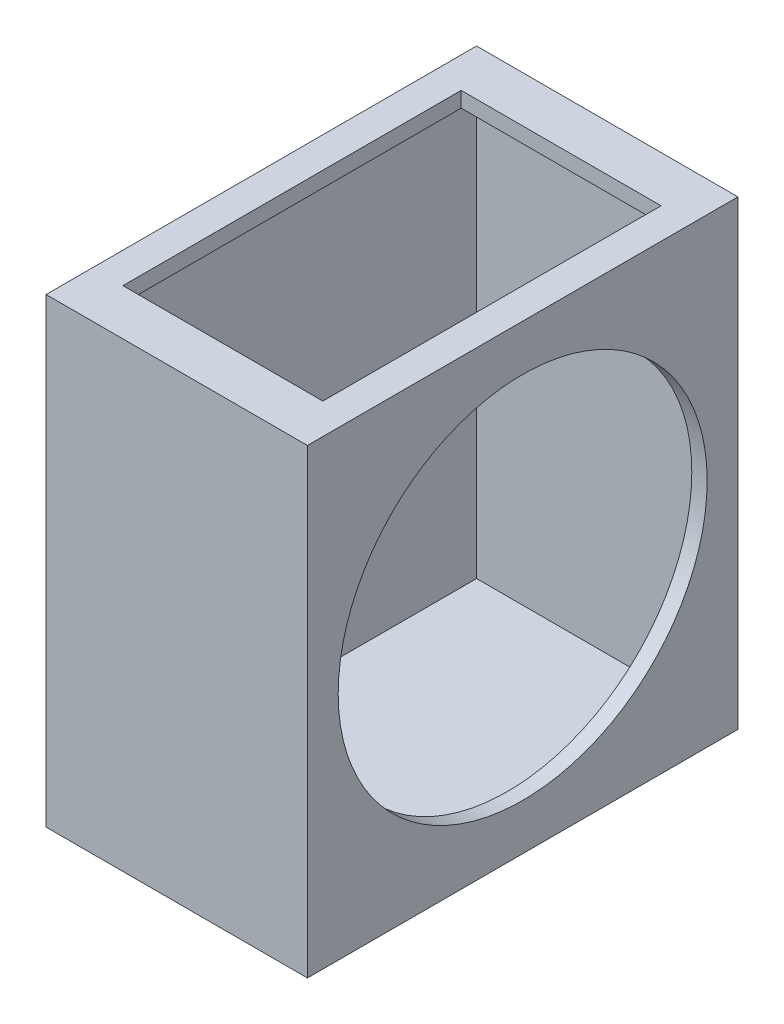
ISO-10303-21;
HEADER;
FILE_DESCRIPTION(('STEP AP214'),'2;1');
FILE_NAME('part.step','',(''),(''),'','','');
FILE_SCHEMA(('AUTOMOTIVE_DESIGN { 1 0 10303 214 1 1 1 1 }'));
ENDSEC;
DATA;
#1=APPLICATION_CONTEXT('core data for automotive mechanical design processes');
#2=APPLICATION_PROTOCOL_DEFINITION('international standard','automotive_design',2000,#1);
#3=PRODUCT_CONTEXT('',#1,'mechanical');
#4=PRODUCT('Part','Part','',(#3));
#5=PRODUCT_RELATED_PRODUCT_CATEGORY('part','',(#4));
#6=PRODUCT_DEFINITION_FORMATION('','',#4);
#7=PRODUCT_DEFINITION_CONTEXT('part definition',#1,'design');
#8=PRODUCT_DEFINITION('design','',#6,#7);
#9=PRODUCT_DEFINITION_SHAPE('','',#8);
#10=(LENGTH_UNIT() NAMED_UNIT(*) SI_UNIT(.MILLI.,.METRE.));
#11=(NAMED_UNIT(*) PLANE_ANGLE_UNIT() SI_UNIT($,.RADIAN.));
#12=(NAMED_UNIT(*) SI_UNIT($,.STERADIAN.) SOLID_ANGLE_UNIT());
#13=UNCERTAINTY_MEASURE_WITH_UNIT(LENGTH_MEASURE(1.E-05),#10,'distance_accuracy_value','');
#14=(GEOMETRIC_REPRESENTATION_CONTEXT(3) GLOBAL_UNCERTAINTY_ASSIGNED_CONTEXT((#13)) GLOBAL_UNIT_ASSIGNED_CONTEXT((#10,
#11,#12)) REPRESENTATION_CONTEXT('',''));
#15=CARTESIAN_POINT('',(0.,0.,0.));
#16=DIRECTION('',(0.,0.,1.));
#17=DIRECTION('',(1.,0.,0.));
#18=AXIS2_PLACEMENT_3D('',#15,#16,#17);
#19=CARTESIAN_POINT('',(-36.2877822295091,77.1183338929011,77.));
#20=DIRECTION('',(0.,-1.,0.));
#21=DIRECTION('',(0.,0.,-1.));
#22=AXIS2_PLACEMENT_3D('',#19,#20,#21);
#23=PLANE('',#22);
#24=DIRECTION('',(0.,0.,-1.));
#25=VECTOR('',#24,1.);
#26=CARTESIAN_POINT('',(43.7122177704909,77.1183338929011,77.));
#27=LINE('',#26,#25);
#28=CARTESIAN_POINT('',(43.7122177704909,77.1183338929011,72.));
#29=VERTEX_POINT('',#28);
#30=CARTESIAN_POINT('',(43.7122177704909,77.1183338929011,-58.));
#31=VERTEX_POINT('',#30);
#32=EDGE_CURVE('E194',#29,#31,#27,.T.);
#33=ORIENTED_EDGE('',*,*,#32,.F.);
#34=DIRECTION('',(-1.,0.,0.));
#35=VECTOR('',#34,1.);
#36=CARTESIAN_POINT('',(6.21221777049086,77.1183338929011,72.));
#37=LINE('',#36,#35);
#38=CARTESIAN_POINT('',(-31.2877822295091,77.1183338929011,72.));
#39=VERTEX_POINT('',#38);
#40=EDGE_CURVE('E210',#29,#39,#37,.T.);
#41=ORIENTED_EDGE('',*,*,#40,.T.);
#42=DIRECTION('',(0.,0.,-1.));
#43=VECTOR('',#42,1.);
#44=CARTESIAN_POINT('',(-31.2877822295091,77.1183338929011,77.));
#45=LINE('',#44,#43);
#46=CARTESIAN_POINT('',(-31.2877822295091,77.1183338929011,-58.));
#47=VERTEX_POINT('',#46);
#48=EDGE_CURVE('E204',#39,#47,#45,.T.);
#49=ORIENTED_EDGE('',*,*,#48,.T.);
#50=DIRECTION('',(-1.,0.,0.));
#51=VECTOR('',#50,1.);
#52=CARTESIAN_POINT('',(6.21221777049086,77.1183338929011,-58.));
#53=LINE('',#52,#51);
#54=EDGE_CURVE('E200',#31,#47,#53,.T.);
#55=ORIENTED_EDGE('',*,*,#54,.F.);
#56=EDGE_LOOP('',(#33,#41,#49,#55));
#57=FACE_BOUND('',#56,.T.);
#58=DIRECTION('',(1.,0.,0.));
#59=VECTOR('',#58,1.);
#60=CARTESIAN_POINT('',(-26.2877822295091,77.1183338929011,62.));
#61=LINE('',#60,#59);
#62=CARTESIAN_POINT('',(-26.2877822295091,77.1183338929011,62.));
#63=VERTEX_POINT('',#62);
#64=CARTESIAN_POINT('',(38.7122177704909,77.1183338929011,62.));
#65=VERTEX_POINT('',#64);
#66=EDGE_CURVE('E137',#63,#65,#61,.T.);
#67=ORIENTED_EDGE('',*,*,#66,.T.);
#68=DIRECTION('',(0.,0.,-1.));
#69=VECTOR('',#68,1.);
#70=CARTESIAN_POINT('',(38.7122177704909,77.1183338929011,62.));
#71=LINE('',#70,#69);
#72=CARTESIAN_POINT('',(38.7122177704909,77.1183338929011,-48.));
#73=VERTEX_POINT('',#72);
#74=EDGE_CURVE('E167',#65,#73,#71,.T.);
#75=ORIENTED_EDGE('',*,*,#74,.T.);
#76=DIRECTION('',(-1.,0.,0.));
#77=VECTOR('',#76,1.);
#78=CARTESIAN_POINT('',(-26.2877822295091,77.1183338929011,-48.));
#79=LINE('',#78,#77);
#80=CARTESIAN_POINT('',(-26.2877822295091,77.1183338929011,-48.));
#81=VERTEX_POINT('',#80);
#82=EDGE_CURVE('E157',#73,#81,#79,.T.);
#83=ORIENTED_EDGE('',*,*,#82,.T.);
#84=DIRECTION('',(0.,0.,1.));
#85=VECTOR('',#84,1.);
#86=CARTESIAN_POINT('',(-26.2877822295091,77.1183338929011,62.));
#87=LINE('',#86,#85);
#88=EDGE_CURVE('E141',#81,#63,#87,.T.);
#89=ORIENTED_EDGE('',*,*,#88,.T.);
#90=EDGE_LOOP('',(#67,#75,#83,#89));
#91=FACE_BOUND('',#90,.T.);
#92=ADVANCED_FACE('F44',(#57,#91),#23,.T.);
#93=CARTESIAN_POINT('',(48.7122177704909,-67.8816661070988,77.));
#94=DIRECTION('',(-1.,0.,0.));
#95=DIRECTION('',(0.,0.,1.));
#96=AXIS2_PLACEMENT_3D('',#93,#94,#95);
#97=PLANE('',#96);
#98=DIRECTION('',(0.,1.,0.));
#99=VECTOR('',#98,1.);
#100=CARTESIAN_POINT('',(48.7122177704909,-67.8816661070988,-63.));
#101=LINE('',#100,#99);
#102=CARTESIAN_POINT('',(48.7122177704909,-67.8816661070988,-63.));
#103=VERTEX_POINT('',#102);
#104=CARTESIAN_POINT('',(48.7122177704909,82.1183338929012,-63.));
#105=VERTEX_POINT('',#104);
#106=EDGE_CURVE('E208',#103,#105,#101,.T.);
#107=ORIENTED_EDGE('',*,*,#106,.T.);
#108=DIRECTION('',(0.,0.,-1.));
#109=VECTOR('',#108,1.);
#110=CARTESIAN_POINT('',(48.7122177704909,82.1183338929012,77.));
#111=LINE('',#110,#109);
#112=CARTESIAN_POINT('',(48.7122177704909,82.1183338929012,77.));
#113=VERTEX_POINT('',#112);
#114=EDGE_CURVE('E53',#113,#105,#111,.T.);
#115=ORIENTED_EDGE('',*,*,#114,.F.);
#116=DIRECTION('',(0.,1.,0.));
#117=VECTOR('',#116,1.);
#118=CARTESIAN_POINT('',(48.7122177704909,-67.8816661070988,77.));
#119=LINE('',#118,#117);
#120=CARTESIAN_POINT('',(48.7122177704909,-67.8816661070988,77.));
#121=VERTEX_POINT('',#120);
#122=EDGE_CURVE('E229',#121,#113,#119,.T.);
#123=ORIENTED_EDGE('',*,*,#122,.F.);
#124=DIRECTION('',(0.,0.,-1.));
#125=VECTOR('',#124,1.);
#126=CARTESIAN_POINT('',(48.7122177704909,-67.8816661070988,77.));
#127=LINE('',#126,#125);
#128=EDGE_CURVE('E243',#121,#103,#127,.T.);
#129=ORIENTED_EDGE('',*,*,#128,.T.);
#130=EDGE_LOOP('',(#107,#115,#123,#129));
#131=FACE_BOUND('',#130,.T.);
#132=CARTESIAN_POINT('',(48.7122177704909,7.11833389290117,6.99999999999999));
#133=DIRECTION('',(1.,0.,0.));
#134=DIRECTION('',(0.,0.,-1.));
#135=AXIS2_PLACEMENT_3D('',#132,#133,#134);
#136=CIRCLE('',#135,60.);
#137=CARTESIAN_POINT('',(48.7122177704909,7.11833389290117,-53.));
#138=VERTEX_POINT('',#137);
#139=EDGE_CURVE('E183',#138,#138,#136,.T.);
#140=ORIENTED_EDGE('',*,*,#139,.F.);
#141=EDGE_LOOP('',(#140));
#142=FACE_BOUND('',#141,.T.);
#143=ADVANCED_FACE('F46',(#131,#142),#97,.F.);
#144=CARTESIAN_POINT('',(-36.2877822295091,82.1183338929012,77.));
#145=DIRECTION('',(0.,-1.,0.));
#146=DIRECTION('',(0.,0.,-1.));
#147=AXIS2_PLACEMENT_3D('',#144,#145,#146);
#148=PLANE('',#147);
#149=DIRECTION('',(0.,0.,1.));
#150=VECTOR('',#149,1.);
#151=CARTESIAN_POINT('',(-26.2877822295091,82.1183338929012,62.));
#152=LINE('',#151,#150);
#153=CARTESIAN_POINT('',(-26.2877822295091,82.1183338929012,-48.));
#154=VERTEX_POINT('',#153);
#155=CARTESIAN_POINT('',(-26.2877822295091,82.1183338929012,62.));
#156=VERTEX_POINT('',#155);
#157=EDGE_CURVE('E144',#154,#156,#152,.T.);
#158=ORIENTED_EDGE('',*,*,#157,.F.);
#159=DIRECTION('',(-1.,0.,0.));
#160=VECTOR('',#159,1.);
#161=CARTESIAN_POINT('',(-26.2877822295091,82.1183338929012,-48.));
#162=LINE('',#161,#160);
#163=CARTESIAN_POINT('',(38.7122177704909,82.1183338929012,-48.));
#164=VERTEX_POINT('',#163);
#165=EDGE_CURVE('E149',#164,#154,#162,.T.);
#166=ORIENTED_EDGE('',*,*,#165,.F.);
#167=DIRECTION('',(0.,0.,-1.));
#168=VECTOR('',#167,1.);
#169=CARTESIAN_POINT('',(38.7122177704909,82.1183338929012,62.));
#170=LINE('',#169,#168);
#171=CARTESIAN_POINT('',(38.7122177704909,82.1183338929012,62.));
#172=VERTEX_POINT('',#171);
#173=EDGE_CURVE('E155',#172,#164,#170,.T.);
#174=ORIENTED_EDGE('',*,*,#173,.F.);
#175=DIRECTION('',(1.,0.,0.));
#176=VECTOR('',#175,1.);
#177=CARTESIAN_POINT('',(-26.2877822295091,82.1183338929012,62.));
#178=LINE('',#177,#176);
#179=EDGE_CURVE('E68',#156,#172,#178,.T.);
#180=ORIENTED_EDGE('',*,*,#179,.F.);
#181=EDGE_LOOP('',(#158,#166,#174,#180));
#182=FACE_BOUND('',#181,.T.);
#183=DIRECTION('',(0.,0.,-1.));
#184=VECTOR('',#183,1.);
#185=CARTESIAN_POINT('',(-36.2877822295091,82.1183338929012,77.));
#186=LINE('',#185,#184);
#187=CARTESIAN_POINT('',(-36.2877822295091,82.1183338929012,77.));
#188=VERTEX_POINT('',#187);
#189=CARTESIAN_POINT('',(-36.2877822295091,82.1183338929012,-63.));
#190=VERTEX_POINT('',#189);
#191=EDGE_CURVE('E262',#188,#190,#186,.T.);
#192=ORIENTED_EDGE('',*,*,#191,.F.);
#193=DIRECTION('',(-1.,0.,0.));
#194=VECTOR('',#193,1.);
#195=CARTESIAN_POINT('',(-36.2877822295091,82.1183338929012,77.));
#196=LINE('',#195,#194);
#197=EDGE_CURVE('E233',#113,#188,#196,.T.);
#198=ORIENTED_EDGE('',*,*,#197,.F.);
#199=ORIENTED_EDGE('',*,*,#114,.T.);
#200=DIRECTION('',(-1.,0.,0.));
#201=VECTOR('',#200,1.);
#202=CARTESIAN_POINT('',(-36.2877822295091,82.1183338929012,-63.));
#203=LINE('',#202,#201);
#204=EDGE_CURVE('E247',#105,#190,#203,.T.);
#205=ORIENTED_EDGE('',*,*,#204,.T.);
#206=EDGE_LOOP('',(#192,#198,#199,#205));
#207=FACE_BOUND('',#206,.T.);
#208=ADVANCED_FACE('F152',(#182,#207),#148,.F.);
#209=CARTESIAN_POINT('',(-36.2877822295091,-67.8816661070988,77.));
#210=DIRECTION('',(1.,0.,0.));
#211=DIRECTION('',(0.,0.,-1.));
#212=AXIS2_PLACEMENT_3D('',#209,#210,#211);
#213=PLANE('',#212);
#214=DIRECTION('',(0.,-1.,0.));
#215=VECTOR('',#214,1.);
#216=CARTESIAN_POINT('',(-36.2877822295091,-67.8816661070988,-63.));
#217=LINE('',#216,#215);
#218=CARTESIAN_POINT('',(-36.2877822295091,-67.8816661070988,-63.));
#219=VERTEX_POINT('',#218);
#220=EDGE_CURVE('E250',#190,#219,#217,.T.);
#221=ORIENTED_EDGE('',*,*,#220,.T.);
#222=DIRECTION('',(0.,0.,-1.));
#223=VECTOR('',#222,1.);
#224=CARTESIAN_POINT('',(-36.2877822295091,-67.8816661070988,77.));
#225=LINE('',#224,#223);
#226=CARTESIAN_POINT('',(-36.2877822295091,-67.8816661070988,77.));
#227=VERTEX_POINT('',#226);
#228=EDGE_CURVE('E258',#227,#219,#225,.T.);
#229=ORIENTED_EDGE('',*,*,#228,.F.);
#230=DIRECTION('',(0.,-1.,0.));
#231=VECTOR('',#230,1.);
#232=CARTESIAN_POINT('',(-36.2877822295091,-67.8816661070988,77.));
#233=LINE('',#232,#231);
#234=EDGE_CURVE('E237',#188,#227,#233,.T.);
#235=ORIENTED_EDGE('',*,*,#234,.F.);
#236=ORIENTED_EDGE('',*,*,#191,.T.);
#237=EDGE_LOOP('',(#221,#229,#235,#236));
#238=FACE_BOUND('',#237,.T.);
#239=ADVANCED_FACE('F280',(#238),#213,.F.);
#240=CARTESIAN_POINT('',(-36.2877822295091,-67.8816661070988,77.));
#241=DIRECTION('',(0.,1.,0.));
#242=DIRECTION('',(0.,0.,1.));
#243=AXIS2_PLACEMENT_3D('',#240,#241,#242);
#244=PLANE('',#243);
#245=DIRECTION('',(1.,0.,0.));
#246=VECTOR('',#245,1.);
#247=CARTESIAN_POINT('',(-36.2877822295091,-67.8816661070988,-63.));
#248=LINE('',#247,#246);
#249=EDGE_CURVE('E234',#219,#103,#248,.T.);
#250=ORIENTED_EDGE('',*,*,#249,.T.);
#251=ORIENTED_EDGE('',*,*,#128,.F.);
#252=DIRECTION('',(1.,0.,0.));
#253=VECTOR('',#252,1.);
#254=CARTESIAN_POINT('',(-36.2877822295091,-67.8816661070988,77.));
#255=LINE('',#254,#253);
#256=EDGE_CURVE('E240',#227,#121,#255,.T.);
#257=ORIENTED_EDGE('',*,*,#256,.F.);
#258=ORIENTED_EDGE('',*,*,#228,.T.);
#259=EDGE_LOOP('',(#250,#251,#257,#258));
#260=FACE_BOUND('',#259,.T.);
#261=ADVANCED_FACE('F284',(#260),#244,.F.);
#262=CARTESIAN_POINT('',(6.21221777049086,7.11833389290117,77.));
#263=DIRECTION('',(0.,0.,-1.));
#264=DIRECTION('',(-1.,0.,0.));
#265=AXIS2_PLACEMENT_3D('',#262,#263,#264);
#266=PLANE('',#265);
#267=ORIENTED_EDGE('',*,*,#256,.T.);
#268=ORIENTED_EDGE('',*,*,#122,.T.);
#269=ORIENTED_EDGE('',*,*,#197,.T.);
#270=ORIENTED_EDGE('',*,*,#234,.T.);
#271=EDGE_LOOP('',(#267,#268,#269,#270));
#272=FACE_BOUND('',#271,.T.);
#273=ADVANCED_FACE('F286',(#272),#266,.F.);
#274=CARTESIAN_POINT('',(6.21221777049086,7.11833389290117,-63.));
#275=DIRECTION('',(0.,0.,-1.));
#276=DIRECTION('',(-1.,0.,0.));
#277=AXIS2_PLACEMENT_3D('',#274,#275,#276);
#278=PLANE('',#277);
#279=ORIENTED_EDGE('',*,*,#220,.F.);
#280=ORIENTED_EDGE('',*,*,#204,.F.);
#281=ORIENTED_EDGE('',*,*,#106,.F.);
#282=ORIENTED_EDGE('',*,*,#249,.F.);
#283=EDGE_LOOP('',(#279,#280,#281,#282));
#284=FACE_BOUND('',#283,.T.);
#285=ADVANCED_FACE('F277',(#284),#278,.T.);
#286=CARTESIAN_POINT('',(43.7122177704909,7.11833389290117,-63.));
#287=DIRECTION('',(-1.,0.,0.));
#288=DIRECTION('',(0.,0.,1.));
#289=AXIS2_PLACEMENT_3D('',#286,#287,#288);
#290=PLANE('',#289);
#291=DIRECTION('',(0.,0.,1.));
#292=VECTOR('',#291,1.);
#293=CARTESIAN_POINT('',(43.7122177704909,-62.8816661070988,77.));
#294=LINE('',#293,#292);
#295=CARTESIAN_POINT('',(43.7122177704909,-62.8816661070988,-58.));
#296=VERTEX_POINT('',#295);
#297=CARTESIAN_POINT('',(43.7122177704909,-62.8816661070988,72.));
#298=VERTEX_POINT('',#297);
#299=EDGE_CURVE('E188',#296,#298,#294,.T.);
#300=ORIENTED_EDGE('',*,*,#299,.T.);
#301=DIRECTION('',(0.,1.,0.));
#302=VECTOR('',#301,1.);
#303=CARTESIAN_POINT('',(43.7122177704909,7.11833389290117,72.));
#304=LINE('',#303,#302);
#305=EDGE_CURVE('E197',#298,#29,#304,.T.);
#306=ORIENTED_EDGE('',*,*,#305,.T.);
#307=ORIENTED_EDGE('',*,*,#32,.T.);
#308=DIRECTION('',(0.,1.,0.));
#309=VECTOR('',#308,1.);
#310=CARTESIAN_POINT('',(43.7122177704909,7.11833389290117,-58.));
#311=LINE('',#310,#309);
#312=EDGE_CURVE('E11',#296,#31,#311,.T.);
#313=ORIENTED_EDGE('',*,*,#312,.F.);
#314=EDGE_LOOP('',(#300,#306,#307,#313));
#315=FACE_BOUND('',#314,.T.);
#316=CARTESIAN_POINT('',(43.7122177704909,7.11833389290117,6.99999999999999));
#317=DIRECTION('',(1.,0.,0.));
#318=DIRECTION('',(0.,0.,-1.));
#319=AXIS2_PLACEMENT_3D('',#316,#317,#318);
#320=CIRCLE('',#319,60.);
#321=CARTESIAN_POINT('',(43.7122177704909,7.11833389290117,-53.));
#322=VERTEX_POINT('',#321);
#323=EDGE_CURVE('E184',#322,#322,#320,.T.);
#324=ORIENTED_EDGE('',*,*,#323,.T.);
#325=EDGE_LOOP('',(#324));
#326=FACE_BOUND('',#325,.T.);
#327=ADVANCED_FACE('F293',(#315,#326),#290,.T.);
#328=CARTESIAN_POINT('',(43.7122177704909,7.11833389290117,6.99999999999999));
#329=DIRECTION('',(1.,0.,0.));
#330=DIRECTION('',(0.,0.,-1.));
#331=AXIS2_PLACEMENT_3D('',#328,#329,#330);
#332=CYLINDRICAL_SURFACE('',#331,60.);
#333=ORIENTED_EDGE('',*,*,#323,.F.);
#334=EDGE_LOOP('',(#333));
#335=FACE_BOUND('',#334,.T.);
#336=ORIENTED_EDGE('',*,*,#139,.T.);
#337=EDGE_LOOP('',(#336));
#338=FACE_BOUND('',#337,.T.);
#339=ADVANCED_FACE('F312',(#335,#338),#332,.F.);
#340=CARTESIAN_POINT('',(-31.2877822295091,-67.8816661070988,77.));
#341=DIRECTION('',(1.,0.,0.));
#342=DIRECTION('',(0.,0.,-1.));
#343=AXIS2_PLACEMENT_3D('',#340,#341,#342);
#344=PLANE('',#343);
#345=DIRECTION('',(0.,-1.,0.));
#346=VECTOR('',#345,1.);
#347=CARTESIAN_POINT('',(-31.2877822295091,7.11833389290117,-58.));
#348=LINE('',#347,#346);
#349=CARTESIAN_POINT('',(-31.2877822295091,-62.8816661070988,-58.));
#350=VERTEX_POINT('',#349);
#351=EDGE_CURVE('E203',#47,#350,#348,.T.);
#352=ORIENTED_EDGE('',*,*,#351,.F.);
#353=ORIENTED_EDGE('',*,*,#48,.F.);
#354=DIRECTION('',(0.,-1.,0.));
#355=VECTOR('',#354,1.);
#356=CARTESIAN_POINT('',(-31.2877822295091,7.11833389290117,72.));
#357=LINE('',#356,#355);
#358=CARTESIAN_POINT('',(-31.2877822295091,-62.8816661070988,72.));
#359=VERTEX_POINT('',#358);
#360=EDGE_CURVE('E213',#39,#359,#357,.T.);
#361=ORIENTED_EDGE('',*,*,#360,.T.);
#362=DIRECTION('',(0.,0.,-1.));
#363=VECTOR('',#362,1.);
#364=CARTESIAN_POINT('',(-31.2877822295091,-62.8816661070988,77.));
#365=LINE('',#364,#363);
#366=EDGE_CURVE('E209',#359,#350,#365,.T.);
#367=ORIENTED_EDGE('',*,*,#366,.T.);
#368=EDGE_LOOP('',(#352,#353,#361,#367));
#369=FACE_BOUND('',#368,.T.);
#370=ADVANCED_FACE('F308',(#369),#344,.T.);
#371=CARTESIAN_POINT('',(6.21221777049086,7.11833389290117,72.));
#372=DIRECTION('',(0.,0.,-1.));
#373=DIRECTION('',(-1.,0.,0.));
#374=AXIS2_PLACEMENT_3D('',#371,#372,#373);
#375=PLANE('',#374);
#376=ORIENTED_EDGE('',*,*,#305,.F.);
#377=DIRECTION('',(1.,0.,0.));
#378=VECTOR('',#377,1.);
#379=CARTESIAN_POINT('',(6.21221777049086,-62.8816661070988,72.));
#380=LINE('',#379,#378);
#381=EDGE_CURVE('E220',#359,#298,#380,.T.);
#382=ORIENTED_EDGE('',*,*,#381,.F.);
#383=ORIENTED_EDGE('',*,*,#360,.F.);
#384=ORIENTED_EDGE('',*,*,#40,.F.);
#385=EDGE_LOOP('',(#376,#382,#383,#384));
#386=FACE_BOUND('',#385,.T.);
#387=ADVANCED_FACE('F311',(#386),#375,.T.);
#388=CARTESIAN_POINT('',(6.21221777049086,7.11833389290117,-58.));
#389=DIRECTION('',(0.,0.,-1.));
#390=DIRECTION('',(-1.,0.,0.));
#391=AXIS2_PLACEMENT_3D('',#388,#389,#390);
#392=PLANE('',#391);
#393=DIRECTION('',(1.,0.,0.));
#394=VECTOR('',#393,1.);
#395=CARTESIAN_POINT('',(6.21221777049086,-62.8816661070988,-58.));
#396=LINE('',#395,#394);
#397=EDGE_CURVE('E214',#350,#296,#396,.T.);
#398=ORIENTED_EDGE('',*,*,#397,.T.);
#399=ORIENTED_EDGE('',*,*,#312,.T.);
#400=ORIENTED_EDGE('',*,*,#54,.T.);
#401=ORIENTED_EDGE('',*,*,#351,.T.);
#402=EDGE_LOOP('',(#398,#399,#400,#401));
#403=FACE_BOUND('',#402,.T.);
#404=ADVANCED_FACE('F318',(#403),#392,.F.);
#405=CARTESIAN_POINT('',(-36.2877822295091,-62.8816661070988,77.));
#406=DIRECTION('',(0.,1.,0.));
#407=DIRECTION('',(0.,0.,1.));
#408=AXIS2_PLACEMENT_3D('',#405,#406,#407);
#409=PLANE('',#408);
#410=ORIENTED_EDGE('',*,*,#299,.F.);
#411=ORIENTED_EDGE('',*,*,#397,.F.);
#412=ORIENTED_EDGE('',*,*,#366,.F.);
#413=ORIENTED_EDGE('',*,*,#381,.T.);
#414=EDGE_LOOP('',(#410,#411,#412,#413));
#415=FACE_BOUND('',#414,.T.);
#416=ADVANCED_FACE('F314',(#415),#409,.T.);
#417=CARTESIAN_POINT('',(-26.2877822295091,-50.6509894989053,-48.));
#418=DIRECTION('',(0.,0.,-1.));
#419=DIRECTION('',(-1.,0.,0.));
#420=AXIS2_PLACEMENT_3D('',#417,#418,#419);
#421=PLANE('',#420);
#422=DIRECTION('',(0.,1.,0.));
#423=VECTOR('',#422,1.);
#424=CARTESIAN_POINT('',(38.7122177704909,-50.6509894989053,-48.));
#425=LINE('',#424,#423);
#426=EDGE_CURVE('E171',#73,#164,#425,.T.);
#427=ORIENTED_EDGE('',*,*,#426,.T.);
#428=ORIENTED_EDGE('',*,*,#165,.T.);
#429=DIRECTION('',(0.,1.,0.));
#430=VECTOR('',#429,1.);
#431=CARTESIAN_POINT('',(-26.2877822295091,-50.6509894989053,-48.));
#432=LINE('',#431,#430);
#433=EDGE_CURVE('E60',#81,#154,#432,.T.);
#434=ORIENTED_EDGE('',*,*,#433,.F.);
#435=ORIENTED_EDGE('',*,*,#82,.F.);
#436=EDGE_LOOP('',(#427,#428,#434,#435));
#437=FACE_BOUND('',#436,.T.);
#438=ADVANCED_FACE('F317',(#437),#421,.F.);
#439=CARTESIAN_POINT('',(-26.2877822295091,-50.6509894989053,62.));
#440=DIRECTION('',(-1.,0.,0.));
#441=DIRECTION('',(0.,0.,1.));
#442=AXIS2_PLACEMENT_3D('',#439,#440,#441);
#443=PLANE('',#442);
#444=ORIENTED_EDGE('',*,*,#433,.T.);
#445=ORIENTED_EDGE('',*,*,#157,.T.);
#446=DIRECTION('',(0.,1.,0.));
#447=VECTOR('',#446,1.);
#448=CARTESIAN_POINT('',(-26.2877822295091,-50.6509894989053,62.));
#449=LINE('',#448,#447);
#450=EDGE_CURVE('E133',#63,#156,#449,.T.);
#451=ORIENTED_EDGE('',*,*,#450,.F.);
#452=ORIENTED_EDGE('',*,*,#88,.F.);
#453=EDGE_LOOP('',(#444,#445,#451,#452));
#454=FACE_BOUND('',#453,.T.);
#455=ADVANCED_FACE('F145',(#454),#443,.F.);
#456=CARTESIAN_POINT('',(-26.2877822295091,-50.6509894989053,62.));
#457=DIRECTION('',(0.,0.,1.));
#458=DIRECTION('',(1.,0.,0.));
#459=AXIS2_PLACEMENT_3D('',#456,#457,#458);
#460=PLANE('',#459);
#461=ORIENTED_EDGE('',*,*,#450,.T.);
#462=ORIENTED_EDGE('',*,*,#179,.T.);
#463=DIRECTION('',(0.,1.,0.));
#464=VECTOR('',#463,1.);
#465=CARTESIAN_POINT('',(38.7122177704909,-50.6509894989053,62.));
#466=LINE('',#465,#464);
#467=EDGE_CURVE('E172',#65,#172,#466,.T.);
#468=ORIENTED_EDGE('',*,*,#467,.F.);
#469=ORIENTED_EDGE('',*,*,#66,.F.);
#470=EDGE_LOOP('',(#461,#462,#468,#469));
#471=FACE_BOUND('',#470,.T.);
#472=ADVANCED_FACE('F135',(#471),#460,.F.);
#473=CARTESIAN_POINT('',(38.7122177704909,-50.6509894989053,62.));
#474=DIRECTION('',(1.,0.,0.));
#475=DIRECTION('',(0.,0.,-1.));
#476=AXIS2_PLACEMENT_3D('',#473,#474,#475);
#477=PLANE('',#476);
#478=ORIENTED_EDGE('',*,*,#467,.T.);
#479=ORIENTED_EDGE('',*,*,#173,.T.);
#480=ORIENTED_EDGE('',*,*,#426,.F.);
#481=ORIENTED_EDGE('',*,*,#74,.F.);
#482=EDGE_LOOP('',(#478,#479,#480,#481));
#483=FACE_BOUND('',#482,.T.);
#484=ADVANCED_FACE('F353',(#483),#477,.F.);
#485=CLOSED_SHELL('',(#92,#143,#208,#239,#261,#273,#285,#327,#339,#370,#387,#404,#416,#438,#455,
#472,#484));
#486=MANIFOLD_SOLID_BREP('B2',#485);
#487=ADVANCED_BREP_SHAPE_REPRESENTATION('',(#18,#486),#14);
#488=SHAPE_DEFINITION_REPRESENTATION(#9,#487);
ENDSEC;
END-ISO-10303-21;
